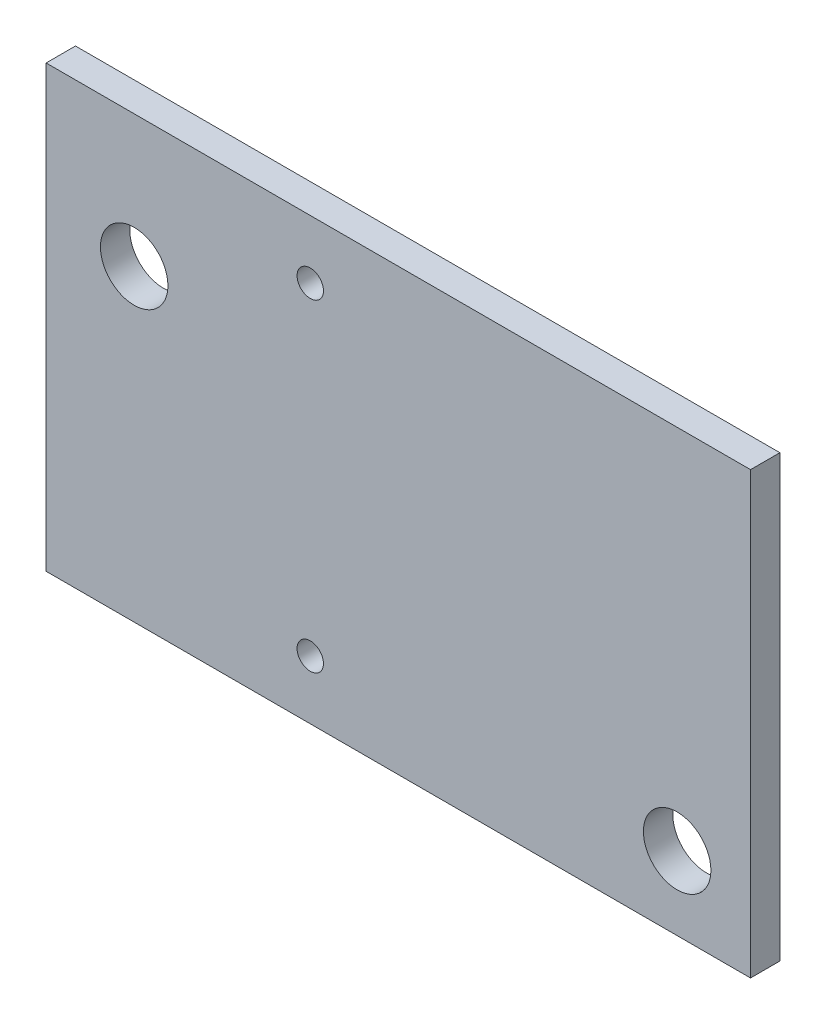
ISO-10303-21;
HEADER;
FILE_DESCRIPTION(('STEP AP214'),'2;1');
FILE_NAME('part.step','',(''),(''),'','','');
FILE_SCHEMA(('AUTOMOTIVE_DESIGN { 1 0 10303 214 1 1 1 1 }'));
ENDSEC;
DATA;
#1=APPLICATION_CONTEXT('core data for automotive mechanical design processes');
#2=APPLICATION_PROTOCOL_DEFINITION('international standard','automotive_design',2000,#1);
#3=PRODUCT_CONTEXT('',#1,'mechanical');
#4=PRODUCT('Part','Part','',(#3));
#5=PRODUCT_RELATED_PRODUCT_CATEGORY('part','',(#4));
#6=PRODUCT_DEFINITION_FORMATION('','',#4);
#7=PRODUCT_DEFINITION_CONTEXT('part definition',#1,'design');
#8=PRODUCT_DEFINITION('design','',#6,#7);
#9=PRODUCT_DEFINITION_SHAPE('','',#8);
#10=(LENGTH_UNIT() NAMED_UNIT(*) SI_UNIT(.MILLI.,.METRE.));
#11=(NAMED_UNIT(*) PLANE_ANGLE_UNIT() SI_UNIT($,.RADIAN.));
#12=(NAMED_UNIT(*) SI_UNIT($,.STERADIAN.) SOLID_ANGLE_UNIT());
#13=UNCERTAINTY_MEASURE_WITH_UNIT(LENGTH_MEASURE(1.E-05),#10,'distance_accuracy_value','');
#14=(GEOMETRIC_REPRESENTATION_CONTEXT(3) GLOBAL_UNCERTAINTY_ASSIGNED_CONTEXT((#13)) GLOBAL_UNIT_ASSIGNED_CONTEXT((#10,
#11,#12)) REPRESENTATION_CONTEXT('',''));
#15=CARTESIAN_POINT('',(0.,0.,0.));
#16=DIRECTION('',(0.,0.,1.));
#17=DIRECTION('',(1.,0.,0.));
#18=AXIS2_PLACEMENT_3D('',#15,#16,#17);
#19=CARTESIAN_POINT('',(0.,15.,1.));
#20=DIRECTION('',(0.,0.,-1.));
#21=DIRECTION('',(-1.,0.,0.));
#22=AXIS2_PLACEMENT_3D('',#19,#20,#21);
#23=PLANE('',#22);
#24=CARTESIAN_POINT('',(9.,13.,1.));
#25=DIRECTION('',(0.,0.,1.));
#26=DIRECTION('',(1.,0.,0.));
#27=AXIS2_PLACEMENT_3D('',#24,#25,#26);
#28=CIRCLE('',#27,0.449999999999998);
#29=CARTESIAN_POINT('',(9.45,13.,1.));
#30=VERTEX_POINT('',#29);
#31=EDGE_CURVE('E118',#30,#30,#28,.T.);
#32=ORIENTED_EDGE('',*,*,#31,.F.);
#33=EDGE_LOOP('',(#32));
#34=FACE_BOUND('',#33,.T.);
#35=CARTESIAN_POINT('',(3.,10.5,1.));
#36=DIRECTION('',(0.,0.,1.));
#37=DIRECTION('',(1.,0.,0.));
#38=AXIS2_PLACEMENT_3D('',#35,#36,#37);
#39=CIRCLE('',#38,1.15);
#40=CARTESIAN_POINT('',(4.15,10.5,1.));
#41=VERTEX_POINT('',#40);
#42=EDGE_CURVE('E97',#41,#41,#39,.T.);
#43=ORIENTED_EDGE('',*,*,#42,.F.);
#44=EDGE_LOOP('',(#43));
#45=FACE_BOUND('',#44,.T.);
#46=DIRECTION('',(0.,-1.,0.));
#47=VECTOR('',#46,1.);
#48=CARTESIAN_POINT('',(0.,0.,1.));
#49=LINE('',#48,#47);
#50=CARTESIAN_POINT('',(0.,15.,1.));
#51=VERTEX_POINT('',#50);
#52=CARTESIAN_POINT('',(0.,0.,1.));
#53=VERTEX_POINT('',#52);
#54=EDGE_CURVE('E82',#51,#53,#49,.T.);
#55=ORIENTED_EDGE('',*,*,#54,.T.);
#56=DIRECTION('',(1.,0.,0.));
#57=VECTOR('',#56,1.);
#58=CARTESIAN_POINT('',(0.,0.,1.));
#59=LINE('',#58,#57);
#60=CARTESIAN_POINT('',(24.,0.,1.));
#61=VERTEX_POINT('',#60);
#62=EDGE_CURVE('E77',#53,#61,#59,.T.);
#63=ORIENTED_EDGE('',*,*,#62,.T.);
#64=DIRECTION('',(0.,1.,0.));
#65=VECTOR('',#64,1.);
#66=CARTESIAN_POINT('',(24.,0.,1.));
#67=LINE('',#66,#65);
#68=CARTESIAN_POINT('',(24.,15.,1.));
#69=VERTEX_POINT('',#68);
#70=EDGE_CURVE('E80',#61,#69,#67,.T.);
#71=ORIENTED_EDGE('',*,*,#70,.T.);
#72=DIRECTION('',(-1.,0.,0.));
#73=VECTOR('',#72,1.);
#74=CARTESIAN_POINT('',(0.,15.,1.));
#75=LINE('',#74,#73);
#76=EDGE_CURVE('E47',#69,#51,#75,.T.);
#77=ORIENTED_EDGE('',*,*,#76,.T.);
#78=EDGE_LOOP('',(#55,#63,#71,#77));
#79=FACE_BOUND('',#78,.T.);
#80=CARTESIAN_POINT('',(21.5,2.5,1.));
#81=DIRECTION('',(0.,0.,1.));
#82=DIRECTION('',(1.,0.,0.));
#83=AXIS2_PLACEMENT_3D('',#80,#81,#82);
#84=CIRCLE('',#83,1.15);
#85=CARTESIAN_POINT('',(22.65,2.5,1.));
#86=VERTEX_POINT('',#85);
#87=EDGE_CURVE('E112',#86,#86,#84,.T.);
#88=ORIENTED_EDGE('',*,*,#87,.F.);
#89=EDGE_LOOP('',(#88));
#90=FACE_BOUND('',#89,.T.);
#91=CARTESIAN_POINT('',(9.,2.,1.));
#92=DIRECTION('',(0.,0.,1.));
#93=DIRECTION('',(1.,0.,0.));
#94=AXIS2_PLACEMENT_3D('',#91,#92,#93);
#95=CIRCLE('',#94,0.45);
#96=CARTESIAN_POINT('',(9.45,2.,1.));
#97=VERTEX_POINT('',#96);
#98=EDGE_CURVE('E124',#97,#97,#95,.T.);
#99=ORIENTED_EDGE('',*,*,#98,.F.);
#100=EDGE_LOOP('',(#99));
#101=FACE_BOUND('',#100,.T.);
#102=ADVANCED_FACE('F30',(#34,#45,#79,#90,#101),#23,.F.);
#103=CARTESIAN_POINT('',(0.,15.,0.));
#104=DIRECTION('',(0.,0.,-1.));
#105=DIRECTION('',(-1.,0.,0.));
#106=AXIS2_PLACEMENT_3D('',#103,#104,#105);
#107=PLANE('',#106);
#108=CARTESIAN_POINT('',(9.,13.,0.));
#109=DIRECTION('',(0.,0.,1.));
#110=DIRECTION('',(1.,0.,0.));
#111=AXIS2_PLACEMENT_3D('',#108,#109,#110);
#112=CIRCLE('',#111,0.449999999999998);
#113=CARTESIAN_POINT('',(9.45,13.,0.));
#114=VERTEX_POINT('',#113);
#115=EDGE_CURVE('E121',#114,#114,#112,.T.);
#116=ORIENTED_EDGE('',*,*,#115,.T.);
#117=EDGE_LOOP('',(#116));
#118=FACE_BOUND('',#117,.T.);
#119=CARTESIAN_POINT('',(3.,10.5,0.));
#120=DIRECTION('',(0.,0.,1.));
#121=DIRECTION('',(1.,0.,0.));
#122=AXIS2_PLACEMENT_3D('',#119,#120,#121);
#123=CIRCLE('',#122,1.15);
#124=CARTESIAN_POINT('',(4.15,10.5,0.));
#125=VERTEX_POINT('',#124);
#126=EDGE_CURVE('E109',#125,#125,#123,.T.);
#127=ORIENTED_EDGE('',*,*,#126,.T.);
#128=EDGE_LOOP('',(#127));
#129=FACE_BOUND('',#128,.T.);
#130=DIRECTION('',(0.,-1.,0.));
#131=VECTOR('',#130,1.);
#132=CARTESIAN_POINT('',(0.,0.,0.));
#133=LINE('',#132,#131);
#134=CARTESIAN_POINT('',(0.,15.,0.));
#135=VERTEX_POINT('',#134);
#136=CARTESIAN_POINT('',(0.,0.,0.));
#137=VERTEX_POINT('',#136);
#138=EDGE_CURVE('E94',#135,#137,#133,.T.);
#139=ORIENTED_EDGE('',*,*,#138,.F.);
#140=DIRECTION('',(-1.,0.,0.));
#141=VECTOR('',#140,1.);
#142=CARTESIAN_POINT('',(0.,15.,0.));
#143=LINE('',#142,#141);
#144=CARTESIAN_POINT('',(24.,15.,0.));
#145=VERTEX_POINT('',#144);
#146=EDGE_CURVE('E70',#145,#135,#143,.T.);
#147=ORIENTED_EDGE('',*,*,#146,.F.);
#148=DIRECTION('',(0.,1.,0.));
#149=VECTOR('',#148,1.);
#150=CARTESIAN_POINT('',(24.,0.,0.));
#151=LINE('',#150,#149);
#152=CARTESIAN_POINT('',(24.,0.,0.));
#153=VERTEX_POINT('',#152);
#154=EDGE_CURVE('E64',#153,#145,#151,.T.);
#155=ORIENTED_EDGE('',*,*,#154,.F.);
#156=DIRECTION('',(1.,0.,0.));
#157=VECTOR('',#156,1.);
#158=CARTESIAN_POINT('',(0.,0.,0.));
#159=LINE('',#158,#157);
#160=EDGE_CURVE('E86',#137,#153,#159,.T.);
#161=ORIENTED_EDGE('',*,*,#160,.F.);
#162=EDGE_LOOP('',(#139,#147,#155,#161));
#163=FACE_BOUND('',#162,.T.);
#164=CARTESIAN_POINT('',(21.5,2.5,0.));
#165=DIRECTION('',(0.,0.,1.));
#166=DIRECTION('',(1.,0.,0.));
#167=AXIS2_PLACEMENT_3D('',#164,#165,#166);
#168=CIRCLE('',#167,1.15);
#169=CARTESIAN_POINT('',(22.65,2.5,0.));
#170=VERTEX_POINT('',#169);
#171=EDGE_CURVE('E115',#170,#170,#168,.T.);
#172=ORIENTED_EDGE('',*,*,#171,.T.);
#173=EDGE_LOOP('',(#172));
#174=FACE_BOUND('',#173,.T.);
#175=CARTESIAN_POINT('',(9.,2.,0.));
#176=DIRECTION('',(0.,0.,1.));
#177=DIRECTION('',(1.,0.,0.));
#178=AXIS2_PLACEMENT_3D('',#175,#176,#177);
#179=CIRCLE('',#178,0.45);
#180=CARTESIAN_POINT('',(9.45,2.,0.));
#181=VERTEX_POINT('',#180);
#182=EDGE_CURVE('E127',#181,#181,#179,.T.);
#183=ORIENTED_EDGE('',*,*,#182,.T.);
#184=EDGE_LOOP('',(#183));
#185=FACE_BOUND('',#184,.T.);
#186=ADVANCED_FACE('F105',(#118,#129,#163,#174,#185),#107,.T.);
#187=CARTESIAN_POINT('',(0.,0.,1.));
#188=DIRECTION('',(1.,0.,0.));
#189=DIRECTION('',(0.,0.,-1.));
#190=AXIS2_PLACEMENT_3D('',#187,#188,#189);
#191=PLANE('',#190);
#192=ORIENTED_EDGE('',*,*,#138,.T.);
#193=DIRECTION('',(0.,0.,-1.));
#194=VECTOR('',#193,1.);
#195=CARTESIAN_POINT('',(0.,0.,1.));
#196=LINE('',#195,#194);
#197=EDGE_CURVE('E11',#53,#137,#196,.T.);
#198=ORIENTED_EDGE('',*,*,#197,.F.);
#199=ORIENTED_EDGE('',*,*,#54,.F.);
#200=DIRECTION('',(0.,0.,-1.));
#201=VECTOR('',#200,1.);
#202=CARTESIAN_POINT('',(0.,15.,1.));
#203=LINE('',#202,#201);
#204=EDGE_CURVE('E90',#51,#135,#203,.T.);
#205=ORIENTED_EDGE('',*,*,#204,.T.);
#206=EDGE_LOOP('',(#192,#198,#199,#205));
#207=FACE_BOUND('',#206,.T.);
#208=ADVANCED_FACE('F32',(#207),#191,.F.);
#209=CARTESIAN_POINT('',(0.,0.,1.));
#210=DIRECTION('',(0.,1.,0.));
#211=DIRECTION('',(0.,0.,1.));
#212=AXIS2_PLACEMENT_3D('',#209,#210,#211);
#213=PLANE('',#212);
#214=ORIENTED_EDGE('',*,*,#160,.T.);
#215=DIRECTION('',(0.,0.,-1.));
#216=VECTOR('',#215,1.);
#217=CARTESIAN_POINT('',(24.,0.,1.));
#218=LINE('',#217,#216);
#219=EDGE_CURVE('E39',#61,#153,#218,.T.);
#220=ORIENTED_EDGE('',*,*,#219,.F.);
#221=ORIENTED_EDGE('',*,*,#62,.F.);
#222=ORIENTED_EDGE('',*,*,#197,.T.);
#223=EDGE_LOOP('',(#214,#220,#221,#222));
#224=FACE_BOUND('',#223,.T.);
#225=ADVANCED_FACE('F85',(#224),#213,.F.);
#226=CARTESIAN_POINT('',(24.,0.,1.));
#227=DIRECTION('',(-1.,0.,0.));
#228=DIRECTION('',(0.,0.,1.));
#229=AXIS2_PLACEMENT_3D('',#226,#227,#228);
#230=PLANE('',#229);
#231=ORIENTED_EDGE('',*,*,#154,.T.);
#232=DIRECTION('',(0.,0.,-1.));
#233=VECTOR('',#232,1.);
#234=CARTESIAN_POINT('',(24.,15.,1.));
#235=LINE('',#234,#233);
#236=EDGE_CURVE('E87',#69,#145,#235,.T.);
#237=ORIENTED_EDGE('',*,*,#236,.F.);
#238=ORIENTED_EDGE('',*,*,#70,.F.);
#239=ORIENTED_EDGE('',*,*,#219,.T.);
#240=EDGE_LOOP('',(#231,#237,#238,#239));
#241=FACE_BOUND('',#240,.T.);
#242=ADVANCED_FACE('F88',(#241),#230,.F.);
#243=CARTESIAN_POINT('',(0.,15.,1.));
#244=DIRECTION('',(0.,-1.,0.));
#245=DIRECTION('',(0.,0.,-1.));
#246=AXIS2_PLACEMENT_3D('',#243,#244,#245);
#247=PLANE('',#246);
#248=ORIENTED_EDGE('',*,*,#146,.T.);
#249=ORIENTED_EDGE('',*,*,#204,.F.);
#250=ORIENTED_EDGE('',*,*,#76,.F.);
#251=ORIENTED_EDGE('',*,*,#236,.T.);
#252=EDGE_LOOP('',(#248,#249,#250,#251));
#253=FACE_BOUND('',#252,.T.);
#254=ADVANCED_FACE('F102',(#253),#247,.F.);
#255=CARTESIAN_POINT('',(3.,10.5,1.));
#256=DIRECTION('',(0.,0.,-1.));
#257=DIRECTION('',(-1.,0.,0.));
#258=AXIS2_PLACEMENT_3D('',#255,#256,#257);
#259=CYLINDRICAL_SURFACE('',#258,1.15);
#260=ORIENTED_EDGE('',*,*,#42,.T.);
#261=EDGE_LOOP('',(#260));
#262=FACE_BOUND('',#261,.T.);
#263=ORIENTED_EDGE('',*,*,#126,.F.);
#264=EDGE_LOOP('',(#263));
#265=FACE_BOUND('',#264,.T.);
#266=ADVANCED_FACE('F147',(#262,#265),#259,.F.);
#267=CARTESIAN_POINT('',(21.5,2.5,1.));
#268=DIRECTION('',(0.,0.,-1.));
#269=DIRECTION('',(-1.,0.,0.));
#270=AXIS2_PLACEMENT_3D('',#267,#268,#269);
#271=CYLINDRICAL_SURFACE('',#270,1.15);
#272=ORIENTED_EDGE('',*,*,#87,.T.);
#273=EDGE_LOOP('',(#272));
#274=FACE_BOUND('',#273,.T.);
#275=ORIENTED_EDGE('',*,*,#171,.F.);
#276=EDGE_LOOP('',(#275));
#277=FACE_BOUND('',#276,.T.);
#278=ADVANCED_FACE('F193',(#274,#277),#271,.F.);
#279=CARTESIAN_POINT('',(9.,13.,1.));
#280=DIRECTION('',(0.,0.,-1.));
#281=DIRECTION('',(-1.,0.,0.));
#282=AXIS2_PLACEMENT_3D('',#279,#280,#281);
#283=CYLINDRICAL_SURFACE('',#282,0.449999999999998);
#284=ORIENTED_EDGE('',*,*,#31,.T.);
#285=EDGE_LOOP('',(#284));
#286=FACE_BOUND('',#285,.T.);
#287=ORIENTED_EDGE('',*,*,#115,.F.);
#288=EDGE_LOOP('',(#287));
#289=FACE_BOUND('',#288,.T.);
#290=ADVANCED_FACE('F201',(#286,#289),#283,.F.);
#291=CARTESIAN_POINT('',(9.,2.,1.));
#292=DIRECTION('',(0.,0.,-1.));
#293=DIRECTION('',(-1.,0.,0.));
#294=AXIS2_PLACEMENT_3D('',#291,#292,#293);
#295=CYLINDRICAL_SURFACE('',#294,0.45);
#296=ORIENTED_EDGE('',*,*,#98,.T.);
#297=EDGE_LOOP('',(#296));
#298=FACE_BOUND('',#297,.T.);
#299=ORIENTED_EDGE('',*,*,#182,.F.);
#300=EDGE_LOOP('',(#299));
#301=FACE_BOUND('',#300,.T.);
#302=ADVANCED_FACE('F133',(#298,#301),#295,.F.);
#303=CLOSED_SHELL('',(#102,#186,#208,#225,#242,#254,#266,#278,#290,#302));
#304=MANIFOLD_SOLID_BREP('B2',#303);
#305=ADVANCED_BREP_SHAPE_REPRESENTATION('',(#18,#304),#14);
#306=SHAPE_DEFINITION_REPRESENTATION(#9,#305);
ENDSEC;
END-ISO-10303-21;
